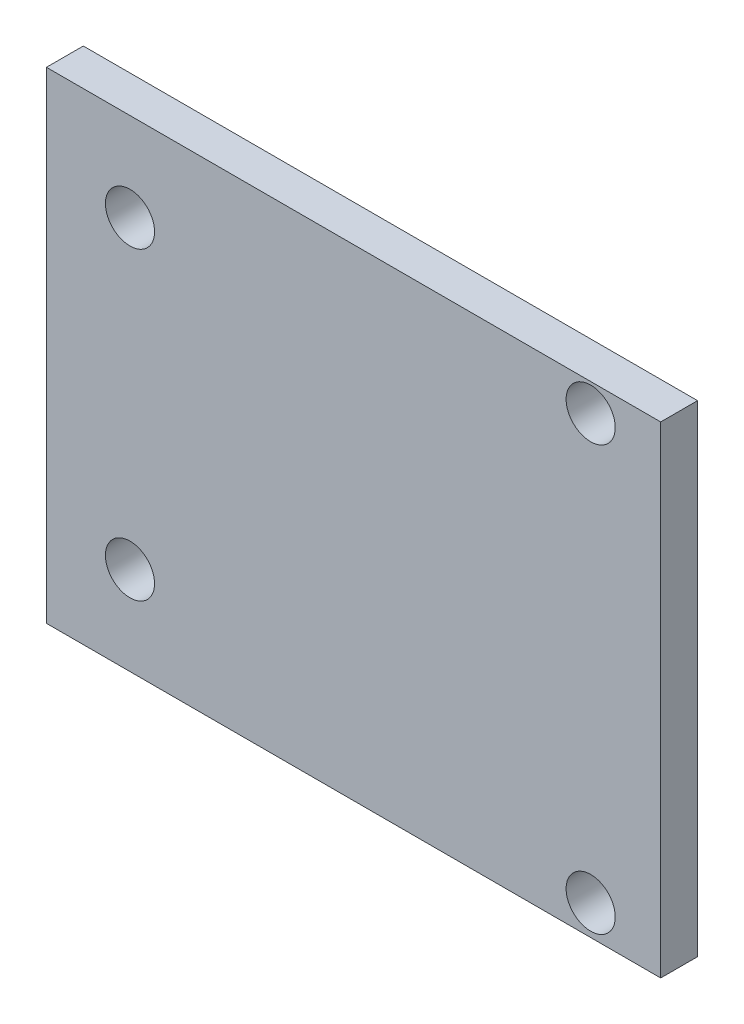
ISO-10303-21;
HEADER;
FILE_DESCRIPTION(('STEP AP214'),'2;1');
FILE_NAME('part.step','',(''),(''),'','','');
FILE_SCHEMA(('AUTOMOTIVE_DESIGN { 1 0 10303 214 1 1 1 1 }'));
ENDSEC;
DATA;
#1=APPLICATION_CONTEXT('core data for automotive mechanical design processes');
#2=APPLICATION_PROTOCOL_DEFINITION('international standard','automotive_design',2000,#1);
#3=PRODUCT_CONTEXT('',#1,'mechanical');
#4=PRODUCT('Part','Part','',(#3));
#5=PRODUCT_RELATED_PRODUCT_CATEGORY('part','',(#4));
#6=PRODUCT_DEFINITION_FORMATION('','',#4);
#7=PRODUCT_DEFINITION_CONTEXT('part definition',#1,'design');
#8=PRODUCT_DEFINITION('design','',#6,#7);
#9=PRODUCT_DEFINITION_SHAPE('','',#8);
#10=(LENGTH_UNIT() NAMED_UNIT(*) SI_UNIT(.MILLI.,.METRE.));
#11=(NAMED_UNIT(*) PLANE_ANGLE_UNIT() SI_UNIT($,.RADIAN.));
#12=(NAMED_UNIT(*) SI_UNIT($,.STERADIAN.) SOLID_ANGLE_UNIT());
#13=UNCERTAINTY_MEASURE_WITH_UNIT(LENGTH_MEASURE(1.E-05),#10,'distance_accuracy_value','');
#14=(GEOMETRIC_REPRESENTATION_CONTEXT(3) GLOBAL_UNCERTAINTY_ASSIGNED_CONTEXT((#13)) GLOBAL_UNIT_ASSIGNED_CONTEXT((#10,
#11,#12)) REPRESENTATION_CONTEXT('',''));
#15=CARTESIAN_POINT('',(0.,0.,0.));
#16=DIRECTION('',(0.,0.,1.));
#17=DIRECTION('',(1.,0.,0.));
#18=AXIS2_PLACEMENT_3D('',#15,#16,#17);
#19=CARTESIAN_POINT('',(0.,0.,3.));
#20=DIRECTION('',(0.,0.,1.));
#21=DIRECTION('',(1.,0.,0.));
#22=AXIS2_PLACEMENT_3D('',#19,#20,#21);
#23=PLANE('',#22);
#24=CARTESIAN_POINT('',(19.3,-17.15,3.));
#25=DIRECTION('',(0.,0.,1.));
#26=DIRECTION('',(1.,0.,0.));
#27=AXIS2_PLACEMENT_3D('',#24,#25,#26);
#28=CIRCLE('',#27,2.);
#29=CARTESIAN_POINT('',(21.3,-17.15,3.));
#30=VERTEX_POINT('',#29);
#31=EDGE_CURVE('E121',#30,#30,#28,.T.);
#32=ORIENTED_EDGE('',*,*,#31,.F.);
#33=EDGE_LOOP('',(#32));
#34=FACE_BOUND('',#33,.T.);
#35=CARTESIAN_POINT('',(-18.2,-12.4,3.));
#36=DIRECTION('',(0.,0.,1.));
#37=DIRECTION('',(1.,0.,0.));
#38=AXIS2_PLACEMENT_3D('',#35,#36,#37);
#39=CIRCLE('',#38,2.);
#40=CARTESIAN_POINT('',(-16.2,-12.4,3.));
#41=VERTEX_POINT('',#40);
#42=EDGE_CURVE('E100',#41,#41,#39,.T.);
#43=ORIENTED_EDGE('',*,*,#42,.F.);
#44=EDGE_LOOP('',(#43));
#45=FACE_BOUND('',#44,.T.);
#46=DIRECTION('',(0.,1.,0.));
#47=VECTOR('',#46,1.);
#48=CARTESIAN_POINT('',(25.,19.6,3.));
#49=LINE('',#48,#47);
#50=CARTESIAN_POINT('',(25.,-19.6,3.));
#51=VERTEX_POINT('',#50);
#52=CARTESIAN_POINT('',(25.,19.6,3.));
#53=VERTEX_POINT('',#52);
#54=EDGE_CURVE('E85',#51,#53,#49,.T.);
#55=ORIENTED_EDGE('',*,*,#54,.T.);
#56=DIRECTION('',(-1.,0.,0.));
#57=VECTOR('',#56,1.);
#58=CARTESIAN_POINT('',(-25.,19.6,3.));
#59=LINE('',#58,#57);
#60=CARTESIAN_POINT('',(-25.,19.6,3.));
#61=VERTEX_POINT('',#60);
#62=EDGE_CURVE('E80',#53,#61,#59,.T.);
#63=ORIENTED_EDGE('',*,*,#62,.T.);
#64=DIRECTION('',(0.,-1.,0.));
#65=VECTOR('',#64,1.);
#66=CARTESIAN_POINT('',(-25.,19.6,3.));
#67=LINE('',#66,#65);
#68=CARTESIAN_POINT('',(-25.,-19.6,3.));
#69=VERTEX_POINT('',#68);
#70=EDGE_CURVE('E83',#61,#69,#67,.T.);
#71=ORIENTED_EDGE('',*,*,#70,.T.);
#72=DIRECTION('',(1.,0.,0.));
#73=VECTOR('',#72,1.);
#74=CARTESIAN_POINT('',(-25.,-19.6,3.));
#75=LINE('',#74,#73);
#76=EDGE_CURVE('E50',#69,#51,#75,.T.);
#77=ORIENTED_EDGE('',*,*,#76,.T.);
#78=EDGE_LOOP('',(#55,#63,#71,#77));
#79=FACE_BOUND('',#78,.T.);
#80=CARTESIAN_POINT('',(-18.2,12.4,3.));
#81=DIRECTION('',(0.,0.,1.));
#82=DIRECTION('',(1.,0.,0.));
#83=AXIS2_PLACEMENT_3D('',#80,#81,#82);
#84=CIRCLE('',#83,2.);
#85=CARTESIAN_POINT('',(-16.2,12.4,3.));
#86=VERTEX_POINT('',#85);
#87=EDGE_CURVE('E115',#86,#86,#84,.T.);
#88=ORIENTED_EDGE('',*,*,#87,.F.);
#89=EDGE_LOOP('',(#88));
#90=FACE_BOUND('',#89,.T.);
#91=CARTESIAN_POINT('',(19.3,17.35,3.));
#92=DIRECTION('',(0.,0.,1.));
#93=DIRECTION('',(1.,0.,0.));
#94=AXIS2_PLACEMENT_3D('',#91,#92,#93);
#95=CIRCLE('',#94,2.);
#96=CARTESIAN_POINT('',(21.3,17.35,3.));
#97=VERTEX_POINT('',#96);
#98=EDGE_CURVE('E127',#97,#97,#95,.T.);
#99=ORIENTED_EDGE('',*,*,#98,.F.);
#100=EDGE_LOOP('',(#99));
#101=FACE_BOUND('',#100,.T.);
#102=ADVANCED_FACE('F33',(#34,#45,#79,#90,#101),#23,.T.);
#103=CARTESIAN_POINT('',(0.,0.,0.));
#104=DIRECTION('',(0.,0.,1.));
#105=DIRECTION('',(1.,0.,0.));
#106=AXIS2_PLACEMENT_3D('',#103,#104,#105);
#107=PLANE('',#106);
#108=DIRECTION('',(0.,1.,0.));
#109=VECTOR('',#108,1.);
#110=CARTESIAN_POINT('',(25.,19.6,0.));
#111=LINE('',#110,#109);
#112=CARTESIAN_POINT('',(25.,-19.6,0.));
#113=VERTEX_POINT('',#112);
#114=CARTESIAN_POINT('',(25.,19.6,0.));
#115=VERTEX_POINT('',#114);
#116=EDGE_CURVE('E97',#113,#115,#111,.T.);
#117=ORIENTED_EDGE('',*,*,#116,.F.);
#118=DIRECTION('',(1.,0.,0.));
#119=VECTOR('',#118,1.);
#120=CARTESIAN_POINT('',(-25.,-19.6,0.));
#121=LINE('',#120,#119);
#122=CARTESIAN_POINT('',(-25.,-19.6,0.));
#123=VERTEX_POINT('',#122);
#124=EDGE_CURVE('E73',#123,#113,#121,.T.);
#125=ORIENTED_EDGE('',*,*,#124,.F.);
#126=DIRECTION('',(0.,-1.,0.));
#127=VECTOR('',#126,1.);
#128=CARTESIAN_POINT('',(-25.,19.6,0.));
#129=LINE('',#128,#127);
#130=CARTESIAN_POINT('',(-25.,19.6,0.));
#131=VERTEX_POINT('',#130);
#132=EDGE_CURVE('E67',#131,#123,#129,.T.);
#133=ORIENTED_EDGE('',*,*,#132,.F.);
#134=DIRECTION('',(-1.,0.,0.));
#135=VECTOR('',#134,1.);
#136=CARTESIAN_POINT('',(-25.,19.6,0.));
#137=LINE('',#136,#135);
#138=EDGE_CURVE('E89',#115,#131,#137,.T.);
#139=ORIENTED_EDGE('',*,*,#138,.F.);
#140=EDGE_LOOP('',(#117,#125,#133,#139));
#141=FACE_BOUND('',#140,.T.);
#142=CARTESIAN_POINT('',(-18.2,-12.4,0.));
#143=DIRECTION('',(0.,0.,1.));
#144=DIRECTION('',(1.,0.,0.));
#145=AXIS2_PLACEMENT_3D('',#142,#143,#144);
#146=CIRCLE('',#145,2.);
#147=CARTESIAN_POINT('',(-16.2,-12.4,0.));
#148=VERTEX_POINT('',#147);
#149=EDGE_CURVE('E112',#148,#148,#146,.T.);
#150=ORIENTED_EDGE('',*,*,#149,.T.);
#151=EDGE_LOOP('',(#150));
#152=FACE_BOUND('',#151,.T.);
#153=CARTESIAN_POINT('',(-18.2,12.4,0.));
#154=DIRECTION('',(0.,0.,1.));
#155=DIRECTION('',(1.,0.,0.));
#156=AXIS2_PLACEMENT_3D('',#153,#154,#155);
#157=CIRCLE('',#156,2.);
#158=CARTESIAN_POINT('',(-16.2,12.4,0.));
#159=VERTEX_POINT('',#158);
#160=EDGE_CURVE('E118',#159,#159,#157,.T.);
#161=ORIENTED_EDGE('',*,*,#160,.T.);
#162=EDGE_LOOP('',(#161));
#163=FACE_BOUND('',#162,.T.);
#164=CARTESIAN_POINT('',(19.3,-17.15,0.));
#165=DIRECTION('',(0.,0.,1.));
#166=DIRECTION('',(1.,0.,0.));
#167=AXIS2_PLACEMENT_3D('',#164,#165,#166);
#168=CIRCLE('',#167,2.);
#169=CARTESIAN_POINT('',(21.3,-17.15,0.));
#170=VERTEX_POINT('',#169);
#171=EDGE_CURVE('E124',#170,#170,#168,.T.);
#172=ORIENTED_EDGE('',*,*,#171,.T.);
#173=EDGE_LOOP('',(#172));
#174=FACE_BOUND('',#173,.T.);
#175=CARTESIAN_POINT('',(19.3,17.35,0.));
#176=DIRECTION('',(0.,0.,1.));
#177=DIRECTION('',(1.,0.,0.));
#178=AXIS2_PLACEMENT_3D('',#175,#176,#177);
#179=CIRCLE('',#178,2.);
#180=CARTESIAN_POINT('',(21.3,17.35,0.));
#181=VERTEX_POINT('',#180);
#182=EDGE_CURVE('E130',#181,#181,#179,.T.);
#183=ORIENTED_EDGE('',*,*,#182,.T.);
#184=EDGE_LOOP('',(#183));
#185=FACE_BOUND('',#184,.T.);
#186=ADVANCED_FACE('F108',(#141,#152,#163,#174,#185),#107,.F.);
#187=CARTESIAN_POINT('',(25.,19.6,3.));
#188=DIRECTION('',(-1.,0.,0.));
#189=DIRECTION('',(0.,-1.,0.));
#190=AXIS2_PLACEMENT_3D('',#187,#188,#189);
#191=PLANE('',#190);
#192=ORIENTED_EDGE('',*,*,#116,.T.);
#193=DIRECTION('',(0.,0.,-1.));
#194=VECTOR('',#193,1.);
#195=CARTESIAN_POINT('',(25.,19.6,3.));
#196=LINE('',#195,#194);
#197=EDGE_CURVE('E11',#53,#115,#196,.T.);
#198=ORIENTED_EDGE('',*,*,#197,.F.);
#199=ORIENTED_EDGE('',*,*,#54,.F.);
#200=DIRECTION('',(0.,0.,-1.));
#201=VECTOR('',#200,1.);
#202=CARTESIAN_POINT('',(25.,-19.6,3.));
#203=LINE('',#202,#201);
#204=EDGE_CURVE('E93',#51,#113,#203,.T.);
#205=ORIENTED_EDGE('',*,*,#204,.T.);
#206=EDGE_LOOP('',(#192,#198,#199,#205));
#207=FACE_BOUND('',#206,.T.);
#208=ADVANCED_FACE('F35',(#207),#191,.F.);
#209=CARTESIAN_POINT('',(-25.,19.6,3.));
#210=DIRECTION('',(0.,-1.,0.));
#211=DIRECTION('',(0.,0.,-1.));
#212=AXIS2_PLACEMENT_3D('',#209,#210,#211);
#213=PLANE('',#212);
#214=ORIENTED_EDGE('',*,*,#138,.T.);
#215=DIRECTION('',(0.,0.,-1.));
#216=VECTOR('',#215,1.);
#217=CARTESIAN_POINT('',(-25.,19.6,3.));
#218=LINE('',#217,#216);
#219=EDGE_CURVE('E42',#61,#131,#218,.T.);
#220=ORIENTED_EDGE('',*,*,#219,.F.);
#221=ORIENTED_EDGE('',*,*,#62,.F.);
#222=ORIENTED_EDGE('',*,*,#197,.T.);
#223=EDGE_LOOP('',(#214,#220,#221,#222));
#224=FACE_BOUND('',#223,.T.);
#225=ADVANCED_FACE('F88',(#224),#213,.F.);
#226=CARTESIAN_POINT('',(-25.,19.6,3.));
#227=DIRECTION('',(1.,0.,0.));
#228=DIRECTION('',(0.,1.,0.));
#229=AXIS2_PLACEMENT_3D('',#226,#227,#228);
#230=PLANE('',#229);
#231=ORIENTED_EDGE('',*,*,#132,.T.);
#232=DIRECTION('',(0.,0.,-1.));
#233=VECTOR('',#232,1.);
#234=CARTESIAN_POINT('',(-25.,-19.6,3.));
#235=LINE('',#234,#233);
#236=EDGE_CURVE('E90',#69,#123,#235,.T.);
#237=ORIENTED_EDGE('',*,*,#236,.F.);
#238=ORIENTED_EDGE('',*,*,#70,.F.);
#239=ORIENTED_EDGE('',*,*,#219,.T.);
#240=EDGE_LOOP('',(#231,#237,#238,#239));
#241=FACE_BOUND('',#240,.T.);
#242=ADVANCED_FACE('F91',(#241),#230,.F.);
#243=CARTESIAN_POINT('',(-25.,-19.6,3.));
#244=DIRECTION('',(0.,1.,0.));
#245=DIRECTION('',(0.,0.,1.));
#246=AXIS2_PLACEMENT_3D('',#243,#244,#245);
#247=PLANE('',#246);
#248=ORIENTED_EDGE('',*,*,#124,.T.);
#249=ORIENTED_EDGE('',*,*,#204,.F.);
#250=ORIENTED_EDGE('',*,*,#76,.F.);
#251=ORIENTED_EDGE('',*,*,#236,.T.);
#252=EDGE_LOOP('',(#248,#249,#250,#251));
#253=FACE_BOUND('',#252,.T.);
#254=ADVANCED_FACE('F105',(#253),#247,.F.);
#255=CARTESIAN_POINT('',(-18.2,-12.4,3.));
#256=DIRECTION('',(0.,0.,-1.));
#257=DIRECTION('',(-1.,0.,0.));
#258=AXIS2_PLACEMENT_3D('',#255,#256,#257);
#259=CYLINDRICAL_SURFACE('',#258,2.);
#260=ORIENTED_EDGE('',*,*,#42,.T.);
#261=EDGE_LOOP('',(#260));
#262=FACE_BOUND('',#261,.T.);
#263=ORIENTED_EDGE('',*,*,#149,.F.);
#264=EDGE_LOOP('',(#263));
#265=FACE_BOUND('',#264,.T.);
#266=ADVANCED_FACE('F149',(#262,#265),#259,.F.);
#267=CARTESIAN_POINT('',(-18.2,12.4,3.));
#268=DIRECTION('',(0.,0.,-1.));
#269=DIRECTION('',(-1.,0.,0.));
#270=AXIS2_PLACEMENT_3D('',#267,#268,#269);
#271=CYLINDRICAL_SURFACE('',#270,2.);
#272=ORIENTED_EDGE('',*,*,#87,.T.);
#273=EDGE_LOOP('',(#272));
#274=FACE_BOUND('',#273,.T.);
#275=ORIENTED_EDGE('',*,*,#160,.F.);
#276=EDGE_LOOP('',(#275));
#277=FACE_BOUND('',#276,.T.);
#278=ADVANCED_FACE('F195',(#274,#277),#271,.F.);
#279=CARTESIAN_POINT('',(19.3,-17.15,3.));
#280=DIRECTION('',(0.,0.,-1.));
#281=DIRECTION('',(-1.,0.,0.));
#282=AXIS2_PLACEMENT_3D('',#279,#280,#281);
#283=CYLINDRICAL_SURFACE('',#282,2.);
#284=ORIENTED_EDGE('',*,*,#31,.T.);
#285=EDGE_LOOP('',(#284));
#286=FACE_BOUND('',#285,.T.);
#287=ORIENTED_EDGE('',*,*,#171,.F.);
#288=EDGE_LOOP('',(#287));
#289=FACE_BOUND('',#288,.T.);
#290=ADVANCED_FACE('F203',(#286,#289),#283,.F.);
#291=CARTESIAN_POINT('',(19.3,17.35,3.));
#292=DIRECTION('',(0.,0.,-1.));
#293=DIRECTION('',(-1.,0.,0.));
#294=AXIS2_PLACEMENT_3D('',#291,#292,#293);
#295=CYLINDRICAL_SURFACE('',#294,2.);
#296=ORIENTED_EDGE('',*,*,#98,.T.);
#297=EDGE_LOOP('',(#296));
#298=FACE_BOUND('',#297,.T.);
#299=ORIENTED_EDGE('',*,*,#182,.F.);
#300=EDGE_LOOP('',(#299));
#301=FACE_BOUND('',#300,.T.);
#302=ADVANCED_FACE('F136',(#298,#301),#295,.F.);
#303=CLOSED_SHELL('',(#102,#186,#208,#225,#242,#254,#266,#278,#290,#302));
#304=MANIFOLD_SOLID_BREP('B2',#303);
#305=ADVANCED_BREP_SHAPE_REPRESENTATION('',(#18,#304),#14);
#306=SHAPE_DEFINITION_REPRESENTATION(#9,#305);
ENDSEC;
END-ISO-10303-21;
